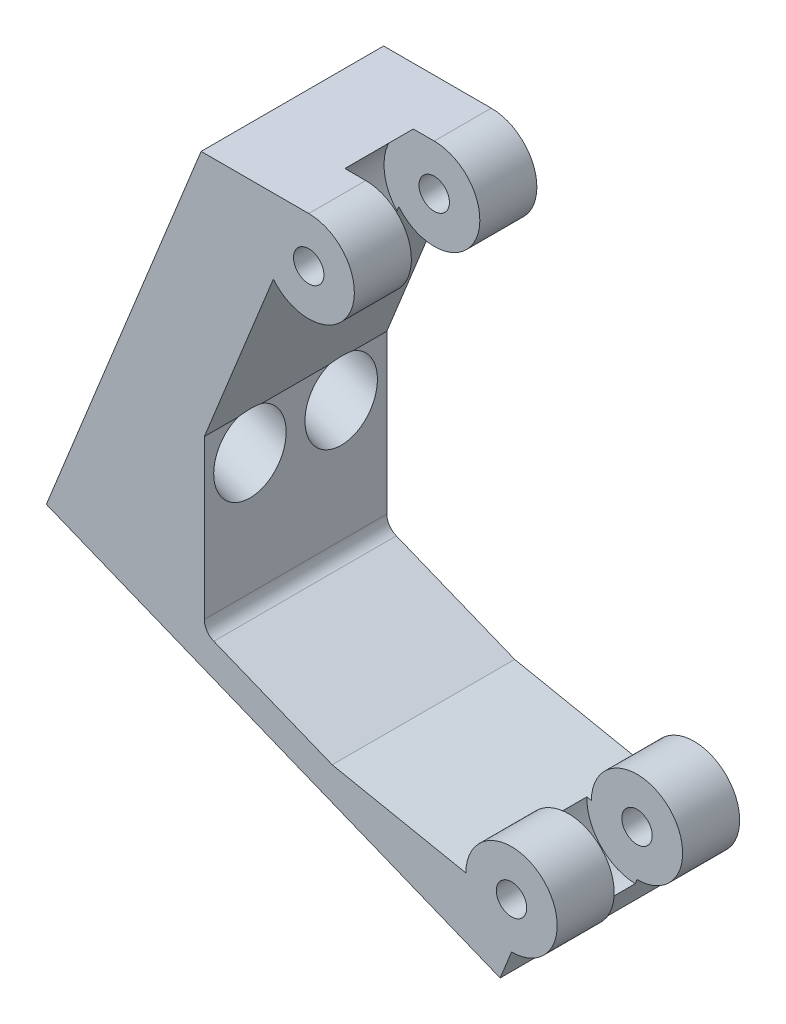
ISO-10303-21;
HEADER;
FILE_DESCRIPTION(('STEP AP214'),'2;1');
FILE_NAME('part.step','',(''),(''),'','','');
FILE_SCHEMA(('AUTOMOTIVE_DESIGN { 1 0 10303 214 1 1 1 1 }'));
ENDSEC;
DATA;
#1=APPLICATION_CONTEXT('core data for automotive mechanical design processes');
#2=APPLICATION_PROTOCOL_DEFINITION('international standard','automotive_design',2000,#1);
#3=PRODUCT_CONTEXT('',#1,'mechanical');
#4=PRODUCT('Part','Part','',(#3));
#5=PRODUCT_RELATED_PRODUCT_CATEGORY('part','',(#4));
#6=PRODUCT_DEFINITION_FORMATION('','',#4);
#7=PRODUCT_DEFINITION_CONTEXT('part definition',#1,'design');
#8=PRODUCT_DEFINITION('design','',#6,#7);
#9=PRODUCT_DEFINITION_SHAPE('','',#8);
#10=(LENGTH_UNIT() NAMED_UNIT(*) SI_UNIT(.MILLI.,.METRE.));
#11=(NAMED_UNIT(*) PLANE_ANGLE_UNIT() SI_UNIT($,.RADIAN.));
#12=(NAMED_UNIT(*) SI_UNIT($,.STERADIAN.) SOLID_ANGLE_UNIT());
#13=UNCERTAINTY_MEASURE_WITH_UNIT(LENGTH_MEASURE(1.E-05),#10,'distance_accuracy_value','');
#14=(GEOMETRIC_REPRESENTATION_CONTEXT(3) GLOBAL_UNCERTAINTY_ASSIGNED_CONTEXT((#13)) GLOBAL_UNIT_ASSIGNED_CONTEXT((#10,
#11,#12)) REPRESENTATION_CONTEXT('',''));
#15=CARTESIAN_POINT('',(0.,0.,0.));
#16=DIRECTION('',(0.,0.,1.));
#17=DIRECTION('',(1.,0.,0.));
#18=AXIS2_PLACEMENT_3D('',#15,#16,#17);
#19=CARTESIAN_POINT('',(32.3757683552172,15.7368485198035,6.));
#20=DIRECTION('',(-0.927183854566786,0.374606593415916,0.));
#21=DIRECTION('',(-0.374606593415916,-0.927183854566786,0.));
#22=AXIS2_PLACEMENT_3D('',#19,#20,#21);
#23=CYLINDRICAL_SURFACE('',#22,1.28840579710145);
#24=CARTESIAN_POINT('',(2.70034237489591,27.7264988786834,6.));
#25=DIRECTION('',(0.927183854566786,-0.374606593415916,0.));
#26=DIRECTION('',(0.374606593415916,0.927183854566786,0.));
#27=AXIS2_PLACEMENT_3D('',#24,#25,#26);
#28=CIRCLE('',#27,1.28840579710145);
#29=CARTESIAN_POINT('',(3.1829876814854,28.9210879318861,6.));
#30=VERTEX_POINT('',#29);
#31=EDGE_CURVE('E303',#30,#30,#28,.F.);
#32=ORIENTED_EDGE('',*,*,#31,.F.);
#33=EDGE_LOOP('',(#32));
#34=FACE_BOUND('',#33,.T.);
#35=CARTESIAN_POINT('',(-0.681358860110469,29.0927948655651,6.));
#36=DIRECTION('',(-0.927183854566787,0.374606593415913,0.));
#37=DIRECTION('',(-0.374606593415913,-0.927183854566787,0.));
#38=AXIS2_PLACEMENT_3D('',#35,#36,#37);
#39=CIRCLE('',#38,1.28840579710145);
#40=CARTESIAN_POINT('',(-1.16400416669996,27.8982058123624,6.));
#41=VERTEX_POINT('',#40);
#42=EDGE_CURVE('E391',#41,#41,#39,.F.);
#43=ORIENTED_EDGE('',*,*,#42,.F.);
#44=EDGE_LOOP('',(#43));
#45=FACE_BOUND('',#44,.T.);
#46=ADVANCED_FACE('F39',(#34,#45),#23,.F.);
#47=CARTESIAN_POINT('',(28.4302213363966,5.97127696398504,3.));
#48=DIRECTION('',(-0.927183854566786,0.374606593415916,0.));
#49=DIRECTION('',(-0.374606593415916,-0.927183854566786,0.));
#50=AXIS2_PLACEMENT_3D('',#47,#48,#49);
#51=CYLINDRICAL_SURFACE('',#50,1.28840579710145);
#52=CARTESIAN_POINT('',(-1.24520464392461,17.9609273228649,3.));
#53=DIRECTION('',(0.927183854566786,-0.374606593415916,0.));
#54=DIRECTION('',(0.374606593415916,0.927183854566786,0.));
#55=AXIS2_PLACEMENT_3D('',#52,#53,#54);
#56=CIRCLE('',#55,1.28840579710145);
#57=CARTESIAN_POINT('',(-0.762559337335123,19.1555163760677,3.));
#58=VERTEX_POINT('',#57);
#59=EDGE_CURVE('E299',#58,#58,#56,.F.);
#60=ORIENTED_EDGE('',*,*,#59,.F.);
#61=EDGE_LOOP('',(#60));
#62=FACE_BOUND('',#61,.T.);
#63=CARTESIAN_POINT('',(-4.62690587893096,19.3272233097467,3.));
#64=DIRECTION('',(-0.927183854566787,0.374606593415913,0.));
#65=DIRECTION('',(-0.374606593415913,-0.927183854566787,0.));
#66=AXIS2_PLACEMENT_3D('',#63,#64,#65);
#67=CIRCLE('',#66,1.28840579710145);
#68=CARTESIAN_POINT('',(-5.10955118552045,18.1326342565439,3.));
#69=VERTEX_POINT('',#68);
#70=EDGE_CURVE('E385',#69,#69,#67,.F.);
#71=ORIENTED_EDGE('',*,*,#70,.F.);
#72=EDGE_LOOP('',(#71));
#73=FACE_BOUND('',#72,.T.);
#74=ADVANCED_FACE('F419',(#62,#73),#51,.F.);
#75=CARTESIAN_POINT('',(28.4302213363966,5.97127696398504,9.));
#76=DIRECTION('',(-0.927183854566786,0.374606593415916,0.));
#77=DIRECTION('',(-0.374606593415916,-0.927183854566786,0.));
#78=AXIS2_PLACEMENT_3D('',#75,#76,#77);
#79=CYLINDRICAL_SURFACE('',#78,1.28840579710145);
#80=CARTESIAN_POINT('',(-1.24520464392461,17.9609273228649,9.));
#81=DIRECTION('',(0.927183854566786,-0.374606593415916,0.));
#82=DIRECTION('',(0.374606593415916,0.927183854566786,0.));
#83=AXIS2_PLACEMENT_3D('',#80,#81,#82);
#84=CIRCLE('',#83,1.28840579710145);
#85=CARTESIAN_POINT('',(-0.762559337335123,19.1555163760677,9.));
#86=VERTEX_POINT('',#85);
#87=EDGE_CURVE('E296',#86,#86,#84,.F.);
#88=ORIENTED_EDGE('',*,*,#87,.F.);
#89=EDGE_LOOP('',(#88));
#90=FACE_BOUND('',#89,.T.);
#91=CARTESIAN_POINT('',(-4.62690587893096,19.3272233097467,9.));
#92=DIRECTION('',(-0.927183854566787,0.374606593415913,0.));
#93=DIRECTION('',(-0.374606593415913,-0.927183854566787,0.));
#94=AXIS2_PLACEMENT_3D('',#91,#92,#93);
#95=CIRCLE('',#94,1.28840579710145);
#96=CARTESIAN_POINT('',(-5.10955118552045,18.1326342565439,9.));
#97=VERTEX_POINT('',#96);
#98=EDGE_CURVE('E382',#97,#97,#95,.F.);
#99=ORIENTED_EDGE('',*,*,#98,.F.);
#100=EDGE_LOOP('',(#99));
#101=FACE_BOUND('',#100,.T.);
#102=ADVANCED_FACE('F426',(#90,#101),#79,.F.);
#103=CARTESIAN_POINT('',(22.1992328045804,2.82866743447979,12.));
#104=DIRECTION('',(0.,0.,1.));
#105=DIRECTION('',(1.,0.,0.));
#106=AXIS2_PLACEMENT_3D('',#103,#104,#105);
#107=PLANE('',#106);
#108=CARTESIAN_POINT('',(8.86544020654602,32.2105327125229,12.));
#109=DIRECTION('',(0.,0.,1.));
#110=DIRECTION('',(1.,0.,0.));
#111=AXIS2_PLACEMENT_3D('',#108,#109,#110);
#112=CIRCLE('',#111,1.00000000000001);
#113=CARTESIAN_POINT('',(9.86544020654602,32.2105327125229,12.));
#114=VERTEX_POINT('',#113);
#115=EDGE_CURVE('E215',#114,#114,#112,.T.);
#116=ORIENTED_EDGE('',*,*,#115,.F.);
#117=EDGE_LOOP('',(#116));
#118=FACE_BOUND('',#117,.T.);
#119=CARTESIAN_POINT('',(22.1992328045804,2.82866743447979,12.));
#120=DIRECTION('',(0.,0.,1.));
#121=DIRECTION('',(1.,0.,0.));
#122=AXIS2_PLACEMENT_3D('',#119,#120,#121);
#123=CIRCLE('',#122,0.999999999999998);
#124=CARTESIAN_POINT('',(23.1992328045804,2.82866743447979,12.));
#125=VERTEX_POINT('',#124);
#126=EDGE_CURVE('E358',#125,#125,#123,.T.);
#127=ORIENTED_EDGE('',*,*,#126,.F.);
#128=EDGE_LOOP('',(#127));
#129=FACE_BOUND('',#128,.T.);
#130=DIRECTION('',(-1.,0.,0.));
#131=VECTOR('',#130,1.);
#132=CARTESIAN_POINT('',(0.,35.2105327125229,12.));
#133=LINE('',#132,#131);
#134=CARTESIAN_POINT('',(8.86544020654602,35.2105327125229,12.));
#135=VERTEX_POINT('',#134);
#136=CARTESIAN_POINT('',(1.79036767284478,35.2105327125229,12.));
#137=VERTEX_POINT('',#136);
#138=EDGE_CURVE('E192',#135,#137,#133,.T.);
#139=ORIENTED_EDGE('',*,*,#138,.T.);
#140=DIRECTION('',(-0.374606593415913,-0.927183854566787,0.));
#141=VECTOR('',#140,1.);
#142=CARTESIAN_POINT('',(-6.59282112902209,14.4614123193155,12.));
#143=LINE('',#142,#141);
#144=CARTESIAN_POINT('',(-8.38402187154173,10.0280349096757,12.));
#145=VERTEX_POINT('',#144);
#146=EDGE_CURVE('E181',#137,#145,#143,.T.);
#147=ORIENTED_EDGE('',*,*,#146,.T.);
#148=DIRECTION('',(0.927183854566787,-0.374606593415913,0.));
#149=VECTOR('',#148,1.);
#150=CARTESIAN_POINT('',(0.,6.64067019559725,12.));
#151=LINE('',#150,#149);
#152=CARTESIAN_POINT('',(21.4500196177493,-2.02570027465208,12.));
#153=VERTEX_POINT('',#152);
#154=EDGE_CURVE('E189',#145,#153,#151,.T.);
#155=ORIENTED_EDGE('',*,*,#154,.T.);
#156=DIRECTION('',(0.374606593415912,0.927183854566787,0.));
#157=VECTOR('',#156,1.);
#158=CARTESIAN_POINT('',(22.1992328045804,-0.17133256552021,12.));
#159=LINE('',#158,#157);
#160=CARTESIAN_POINT('',(22.1992328045804,-0.17133256552021,12.));
#161=VERTEX_POINT('',#160);
#162=EDGE_CURVE('E199',#153,#161,#159,.T.);
#163=ORIENTED_EDGE('',*,*,#162,.T.);
#164=CARTESIAN_POINT('',(22.1992328045804,2.82866743447979,12.));
#165=DIRECTION('',(0.,0.,1.));
#166=DIRECTION('',(1.,0.,0.));
#167=AXIS2_PLACEMENT_3D('',#164,#165,#166);
#168=CIRCLE('',#167,3.);
#169=CARTESIAN_POINT('',(19.1992328045804,2.82866743445759,12.));
#170=VERTEX_POINT('',#169);
#171=EDGE_CURVE('E201',#161,#170,#168,.T.);
#172=ORIENTED_EDGE('',*,*,#171,.T.);
#173=DIRECTION('',(-0.980453146044322,0.19675270877879,0.));
#174=VECTOR('',#173,1.);
#175=CARTESIAN_POINT('',(10.4069387354306,4.59306350117868,12.));
#176=LINE('',#175,#174);
#177=CARTESIAN_POINT('',(10.4069387354306,4.59306350117868,12.));
#178=VERTEX_POINT('',#177);
#179=EDGE_CURVE('E208',#170,#178,#176,.T.);
#180=ORIENTED_EDGE('',*,*,#179,.T.);
#181=DIRECTION('',(-0.927183854566787,0.374606593415913,0.));
#182=VECTOR('',#181,1.);
#183=CARTESIAN_POINT('',(2.,7.9896872292821,12.));
#184=LINE('',#183,#182);
#185=CARTESIAN_POINT('',(2.62539340658409,7.73701189155774,12.));
#186=VERTEX_POINT('',#185);
#187=EDGE_CURVE('E237',#178,#186,#184,.T.);
#188=ORIENTED_EDGE('',*,*,#187,.T.);
#189=CARTESIAN_POINT('',(3.,8.66419574612453,12.));
#190=DIRECTION('',(0.,0.,1.));
#191=DIRECTION('',(1.,0.,0.));
#192=AXIS2_PLACEMENT_3D('',#189,#190,#191);
#193=CIRCLE('',#192,1.);
#194=CARTESIAN_POINT('',(2.,8.66419574612453,12.));
#195=VERTEX_POINT('',#194);
#196=EDGE_CURVE('E293',#186,#195,#193,.F.);
#197=ORIENTED_EDGE('',*,*,#196,.T.);
#198=DIRECTION('',(0.,1.,0.));
#199=VECTOR('',#198,1.);
#200=CARTESIAN_POINT('',(2.,19.0742676197217,12.));
#201=LINE('',#200,#199);
#202=CARTESIAN_POINT('',(2.,19.0742676197217,12.));
#203=VERTEX_POINT('',#202);
#204=EDGE_CURVE('E370',#195,#203,#201,.T.);
#205=ORIENTED_EDGE('',*,*,#204,.T.);
#206=DIRECTION('',(0.374606593415916,0.927183854566786,0.));
#207=VECTOR('',#206,1.);
#208=CARTESIAN_POINT('',(6.54108801246308,30.3138548595753,12.));
#209=LINE('',#208,#207);
#210=CARTESIAN_POINT('',(6.54108801246308,30.3138548595753,12.));
#211=VERTEX_POINT('',#210);
#212=EDGE_CURVE('E372',#203,#211,#209,.T.);
#213=ORIENTED_EDGE('',*,*,#212,.T.);
#214=CARTESIAN_POINT('',(8.86544020654602,32.2105327125229,12.));
#215=DIRECTION('',(0.,0.,1.));
#216=DIRECTION('',(-1.,0.,0.));
#217=AXIS2_PLACEMENT_3D('',#214,#215,#216);
#218=CIRCLE('',#217,3.);
#219=EDGE_CURVE('E203',#211,#135,#218,.T.);
#220=ORIENTED_EDGE('',*,*,#219,.T.);
#221=EDGE_LOOP('',(#139,#147,#155,#163,#172,#180,#188,#197,#205,#213,#220));
#222=FACE_BOUND('',#221,.T.);
#223=ADVANCED_FACE('F188',(#118,#129,#222),#107,.T.);
#224=CARTESIAN_POINT('',(22.1992328045804,2.82866743447979,0.));
#225=DIRECTION('',(0.,0.,1.));
#226=DIRECTION('',(1.,0.,0.));
#227=AXIS2_PLACEMENT_3D('',#224,#225,#226);
#228=PLANE('',#227);
#229=CARTESIAN_POINT('',(22.1992328045804,2.82866743447979,0.));
#230=DIRECTION('',(0.,0.,1.));
#231=DIRECTION('',(1.,0.,0.));
#232=AXIS2_PLACEMENT_3D('',#229,#230,#231);
#233=CIRCLE('',#232,0.999999999999998);
#234=CARTESIAN_POINT('',(23.1992328045804,2.82866743447979,0.));
#235=VERTEX_POINT('',#234);
#236=EDGE_CURVE('E357',#235,#235,#233,.T.);
#237=ORIENTED_EDGE('',*,*,#236,.T.);
#238=EDGE_LOOP('',(#237));
#239=FACE_BOUND('',#238,.T.);
#240=CARTESIAN_POINT('',(8.86544020654602,32.2105327125229,0.));
#241=DIRECTION('',(0.,0.,1.));
#242=DIRECTION('',(1.,0.,0.));
#243=AXIS2_PLACEMENT_3D('',#240,#241,#242);
#244=CIRCLE('',#243,1.00000000000001);
#245=CARTESIAN_POINT('',(9.86544020654602,32.2105327125229,0.));
#246=VERTEX_POINT('',#245);
#247=EDGE_CURVE('E361',#246,#246,#244,.T.);
#248=ORIENTED_EDGE('',*,*,#247,.T.);
#249=EDGE_LOOP('',(#248));
#250=FACE_BOUND('',#249,.T.);
#251=DIRECTION('',(-0.374606593415913,-0.927183854566787,0.));
#252=VECTOR('',#251,1.);
#253=CARTESIAN_POINT('',(-6.59282112902209,14.4614123193155,0.));
#254=LINE('',#253,#252);
#255=CARTESIAN_POINT('',(1.79036767284478,35.2105327125229,0.));
#256=VERTEX_POINT('',#255);
#257=CARTESIAN_POINT('',(-8.38402187154172,10.0280349096757,0.));
#258=VERTEX_POINT('',#257);
#259=EDGE_CURVE('E53',#256,#258,#254,.T.);
#260=ORIENTED_EDGE('',*,*,#259,.F.);
#261=DIRECTION('',(-1.,0.,0.));
#262=VECTOR('',#261,1.);
#263=CARTESIAN_POINT('',(0.,35.2105327125229,0.));
#264=LINE('',#263,#262);
#265=CARTESIAN_POINT('',(8.86544020654602,35.2105327125229,0.));
#266=VERTEX_POINT('',#265);
#267=EDGE_CURVE('E224',#266,#256,#264,.T.);
#268=ORIENTED_EDGE('',*,*,#267,.F.);
#269=CARTESIAN_POINT('',(8.86544020654602,32.2105327125229,0.));
#270=DIRECTION('',(0.,0.,1.));
#271=DIRECTION('',(-1.,0.,0.));
#272=AXIS2_PLACEMENT_3D('',#269,#270,#271);
#273=CIRCLE('',#272,3.);
#274=CARTESIAN_POINT('',(6.54108801246308,30.3138548595753,0.));
#275=VERTEX_POINT('',#274);
#276=EDGE_CURVE('E221',#275,#266,#273,.T.);
#277=ORIENTED_EDGE('',*,*,#276,.F.);
#278=DIRECTION('',(0.374606593415916,0.927183854566786,0.));
#279=VECTOR('',#278,1.);
#280=CARTESIAN_POINT('',(6.54108801246308,30.3138548595753,0.));
#281=LINE('',#280,#279);
#282=CARTESIAN_POINT('',(2.,19.0742676197217,0.));
#283=VERTEX_POINT('',#282);
#284=EDGE_CURVE('E218',#283,#275,#281,.T.);
#285=ORIENTED_EDGE('',*,*,#284,.F.);
#286=DIRECTION('',(0.,1.,0.));
#287=VECTOR('',#286,1.);
#288=CARTESIAN_POINT('',(2.,19.0742676197217,0.));
#289=LINE('',#288,#287);
#290=CARTESIAN_POINT('',(2.,8.66419574612453,0.));
#291=VERTEX_POINT('',#290);
#292=EDGE_CURVE('E214',#291,#283,#289,.T.);
#293=ORIENTED_EDGE('',*,*,#292,.F.);
#294=CARTESIAN_POINT('',(3.,8.66419574612453,0.));
#295=DIRECTION('',(0.,0.,1.));
#296=DIRECTION('',(1.,0.,0.));
#297=AXIS2_PLACEMENT_3D('',#294,#295,#296);
#298=CIRCLE('',#297,1.);
#299=CARTESIAN_POINT('',(2.62539340658409,7.73701189155774,0.));
#300=VERTEX_POINT('',#299);
#301=EDGE_CURVE('E291',#291,#300,#298,.T.);
#302=ORIENTED_EDGE('',*,*,#301,.T.);
#303=DIRECTION('',(-0.927183854566787,0.374606593415913,0.));
#304=VECTOR('',#303,1.);
#305=CARTESIAN_POINT('',(2.,7.9896872292821,0.));
#306=LINE('',#305,#304);
#307=CARTESIAN_POINT('',(10.4069387354306,4.59306350117868,0.));
#308=VERTEX_POINT('',#307);
#309=EDGE_CURVE('E211',#308,#300,#306,.T.);
#310=ORIENTED_EDGE('',*,*,#309,.F.);
#311=DIRECTION('',(-0.980453146044322,0.19675270877879,0.));
#312=VECTOR('',#311,1.);
#313=CARTESIAN_POINT('',(10.4069387354306,4.59306350117868,0.));
#314=LINE('',#313,#312);
#315=CARTESIAN_POINT('',(19.1992328045804,2.82866743445759,0.));
#316=VERTEX_POINT('',#315);
#317=EDGE_CURVE('E235',#316,#308,#314,.T.);
#318=ORIENTED_EDGE('',*,*,#317,.F.);
#319=CARTESIAN_POINT('',(22.1992328045804,2.82866743447979,0.));
#320=DIRECTION('',(0.,0.,1.));
#321=DIRECTION('',(1.,0.,0.));
#322=AXIS2_PLACEMENT_3D('',#319,#320,#321);
#323=CIRCLE('',#322,3.);
#324=CARTESIAN_POINT('',(22.1992328045804,-0.17133256552021,0.));
#325=VERTEX_POINT('',#324);
#326=EDGE_CURVE('E232',#325,#316,#323,.T.);
#327=ORIENTED_EDGE('',*,*,#326,.F.);
#328=DIRECTION('',(0.374606593415912,0.927183854566787,0.));
#329=VECTOR('',#328,1.);
#330=CARTESIAN_POINT('',(22.1992328045804,-0.17133256552021,0.));
#331=LINE('',#330,#329);
#332=CARTESIAN_POINT('',(21.4500196177493,-2.02570027465208,0.));
#333=VERTEX_POINT('',#332);
#334=EDGE_CURVE('E229',#333,#325,#331,.T.);
#335=ORIENTED_EDGE('',*,*,#334,.F.);
#336=DIRECTION('',(0.927183854566787,-0.374606593415913,0.));
#337=VECTOR('',#336,1.);
#338=CARTESIAN_POINT('',(0.,6.64067019559725,0.));
#339=LINE('',#338,#337);
#340=EDGE_CURVE('E227',#258,#333,#339,.T.);
#341=ORIENTED_EDGE('',*,*,#340,.F.);
#342=EDGE_LOOP('',(#260,#268,#277,#285,#293,#302,#310,#318,#327,#335,#341));
#343=FACE_BOUND('',#342,.T.);
#344=ADVANCED_FACE('F470',(#239,#250,#343),#228,.F.);
#345=CARTESIAN_POINT('',(0.,35.2105327125229,12.));
#346=DIRECTION('',(0.,-1.,0.));
#347=DIRECTION('',(1.,0.,0.));
#348=AXIS2_PLACEMENT_3D('',#345,#346,#347);
#349=PLANE('',#348);
#350=DIRECTION('',(0.,0.,-1.));
#351=VECTOR('',#350,1.);
#352=CARTESIAN_POINT('',(1.79036767284479,35.2105327125229,12.));
#353=LINE('',#352,#351);
#354=EDGE_CURVE('E193',#137,#256,#353,.T.);
#355=ORIENTED_EDGE('',*,*,#354,.F.);
#356=ORIENTED_EDGE('',*,*,#138,.F.);
#357=DIRECTION('',(0.,0.,-1.));
#358=VECTOR('',#357,1.);
#359=CARTESIAN_POINT('',(8.86544020654602,35.2105327125229,12.));
#360=LINE('',#359,#358);
#361=CARTESIAN_POINT('',(8.86544020654602,35.2105327125229,8.25));
#362=VERTEX_POINT('',#361);
#363=EDGE_CURVE('E250',#135,#362,#360,.T.);
#364=ORIENTED_EDGE('',*,*,#363,.T.);
#365=DIRECTION('',(-1.,0.,0.));
#366=VECTOR('',#365,1.);
#367=CARTESIAN_POINT('',(0.,35.2105327125229,8.25));
#368=LINE('',#367,#366);
#369=CARTESIAN_POINT('',(7.49066749805929,35.2105327125229,8.25));
#370=VERTEX_POINT('',#369);
#371=EDGE_CURVE('E281',#362,#370,#368,.T.);
#372=ORIENTED_EDGE('',*,*,#371,.T.);
#373=DIRECTION('',(0.,0.,-1.));
#374=VECTOR('',#373,1.);
#375=CARTESIAN_POINT('',(7.49066749805929,35.2105327125229,8.25));
#376=LINE('',#375,#374);
#377=CARTESIAN_POINT('',(7.49066749805929,35.2105327125229,3.75));
#378=VERTEX_POINT('',#377);
#379=EDGE_CURVE('E284',#378,#370,#376,.F.);
#380=ORIENTED_EDGE('',*,*,#379,.F.);
#381=DIRECTION('',(-1.,0.,0.));
#382=VECTOR('',#381,1.);
#383=CARTESIAN_POINT('',(0.,35.2105327125229,3.75));
#384=LINE('',#383,#382);
#385=CARTESIAN_POINT('',(8.86544020654602,35.2105327125229,3.75));
#386=VERTEX_POINT('',#385);
#387=EDGE_CURVE('E276',#386,#378,#384,.T.);
#388=ORIENTED_EDGE('',*,*,#387,.F.);
#389=EDGE_CURVE('E249',#386,#266,#360,.T.);
#390=ORIENTED_EDGE('',*,*,#389,.T.);
#391=ORIENTED_EDGE('',*,*,#267,.T.);
#392=EDGE_LOOP('',(#355,#356,#364,#372,#380,#388,#390,#391));
#393=FACE_BOUND('',#392,.T.);
#394=ADVANCED_FACE('F380',(#393),#349,.F.);
#395=CARTESIAN_POINT('',(0.,6.64067019559725,12.));
#396=DIRECTION('',(0.374606593415913,0.927183854566787,0.));
#397=DIRECTION('',(-0.927183854566787,0.374606593415913,0.));
#398=AXIS2_PLACEMENT_3D('',#395,#396,#397);
#399=PLANE('',#398);
#400=DIRECTION('',(0.,0.,1.));
#401=VECTOR('',#400,1.);
#402=CARTESIAN_POINT('',(-8.38402187154173,10.0280349096757,12.));
#403=LINE('',#402,#401);
#404=EDGE_CURVE('E11',#258,#145,#403,.T.);
#405=ORIENTED_EDGE('',*,*,#404,.F.);
#406=ORIENTED_EDGE('',*,*,#340,.T.);
#407=DIRECTION('',(0.,0.,-1.));
#408=VECTOR('',#407,1.);
#409=CARTESIAN_POINT('',(21.4500196177493,-2.02570027465208,12.));
#410=LINE('',#409,#408);
#411=EDGE_CURVE('E197',#153,#333,#410,.T.);
#412=ORIENTED_EDGE('',*,*,#411,.F.);
#413=ORIENTED_EDGE('',*,*,#154,.F.);
#414=EDGE_LOOP('',(#405,#406,#412,#413));
#415=FACE_BOUND('',#414,.T.);
#416=ADVANCED_FACE('F195',(#415),#399,.F.);
#417=CARTESIAN_POINT('',(8.86544020654602,32.2105327125229,12.));
#418=DIRECTION('',(0.,0.,-1.));
#419=DIRECTION('',(-1.,0.,0.));
#420=AXIS2_PLACEMENT_3D('',#417,#418,#419);
#421=CYLINDRICAL_SURFACE('',#420,3.);
#422=CARTESIAN_POINT('',(8.86544020654602,32.2105327125229,3.75));
#423=DIRECTION('',(0.,0.,1.));
#424=DIRECTION('',(1.,0.,0.));
#425=AXIS2_PLACEMENT_3D('',#422,#423,#424);
#426=CIRCLE('',#425,3.);
#427=CARTESIAN_POINT('',(6.54108801246308,30.3138548595753,3.75));
#428=VERTEX_POINT('',#427);
#429=EDGE_CURVE('E342',#428,#386,#426,.T.);
#430=ORIENTED_EDGE('',*,*,#429,.F.);
#431=DIRECTION('',(0.,0.,-1.));
#432=VECTOR('',#431,1.);
#433=CARTESIAN_POINT('',(6.54108801246308,30.3138548595753,12.));
#434=LINE('',#433,#432);
#435=EDGE_CURVE('E253',#428,#275,#434,.T.);
#436=ORIENTED_EDGE('',*,*,#435,.T.);
#437=ORIENTED_EDGE('',*,*,#276,.T.);
#438=ORIENTED_EDGE('',*,*,#389,.F.);
#439=EDGE_LOOP('',(#430,#436,#437,#438));
#440=FACE_BOUND('',#439,.T.);
#441=ADVANCED_FACE('F489',(#440),#421,.T.);
#442=CARTESIAN_POINT('',(22.1992328045804,2.82866743447979,12.));
#443=DIRECTION('',(0.,0.,-1.));
#444=DIRECTION('',(-1.,0.,0.));
#445=AXIS2_PLACEMENT_3D('',#442,#443,#444);
#446=CYLINDRICAL_SURFACE('',#445,3.);
#447=CARTESIAN_POINT('',(22.1992328045804,2.82866743447979,3.75));
#448=DIRECTION('',(0.,0.,1.));
#449=DIRECTION('',(1.,0.,0.));
#450=AXIS2_PLACEMENT_3D('',#447,#448,#449);
#451=CIRCLE('',#450,3.);
#452=CARTESIAN_POINT('',(22.1992328045804,-0.17133256552021,3.75));
#453=VERTEX_POINT('',#452);
#454=CARTESIAN_POINT('',(19.1992328045804,2.82866743445759,3.75));
#455=VERTEX_POINT('',#454);
#456=EDGE_CURVE('E331',#453,#455,#451,.T.);
#457=ORIENTED_EDGE('',*,*,#456,.F.);
#458=DIRECTION('',(0.,0.,-1.));
#459=VECTOR('',#458,1.);
#460=CARTESIAN_POINT('',(22.1992328045804,-0.17133256552021,12.));
#461=LINE('',#460,#459);
#462=EDGE_CURVE('E244',#453,#325,#461,.T.);
#463=ORIENTED_EDGE('',*,*,#462,.T.);
#464=ORIENTED_EDGE('',*,*,#326,.T.);
#465=DIRECTION('',(0.,0.,-1.));
#466=VECTOR('',#465,1.);
#467=CARTESIAN_POINT('',(19.1992328045804,2.82866743445759,12.));
#468=LINE('',#467,#466);
#469=EDGE_CURVE('E240',#455,#316,#468,.T.);
#470=ORIENTED_EDGE('',*,*,#469,.F.);
#471=EDGE_LOOP('',(#457,#463,#464,#470));
#472=FACE_BOUND('',#471,.T.);
#473=ADVANCED_FACE('F483',(#472),#446,.T.);
#474=CARTESIAN_POINT('',(8.86544020654602,32.2105327125229,12.));
#475=DIRECTION('',(0.,0.,-1.));
#476=DIRECTION('',(-1.,0.,0.));
#477=AXIS2_PLACEMENT_3D('',#474,#475,#476);
#478=CYLINDRICAL_SURFACE('',#477,1.00000000000001);
#479=ORIENTED_EDGE('',*,*,#247,.F.);
#480=EDGE_LOOP('',(#479));
#481=FACE_BOUND('',#480,.T.);
#482=CARTESIAN_POINT('',(8.86544020654602,32.2105327125229,3.75));
#483=DIRECTION('',(0.,0.,1.));
#484=DIRECTION('',(1.,0.,0.));
#485=AXIS2_PLACEMENT_3D('',#482,#483,#484);
#486=CIRCLE('',#485,1.00000000000001);
#487=CARTESIAN_POINT('',(9.86544020654602,32.2105327125229,3.75));
#488=VERTEX_POINT('',#487);
#489=EDGE_CURVE('E273',#488,#488,#486,.T.);
#490=ORIENTED_EDGE('',*,*,#489,.T.);
#491=EDGE_LOOP('',(#490));
#492=FACE_BOUND('',#491,.T.);
#493=ADVANCED_FACE('F467',(#481,#492),#478,.F.);
#494=CARTESIAN_POINT('',(22.1992328045804,2.82866743447979,12.));
#495=DIRECTION('',(0.,0.,-1.));
#496=DIRECTION('',(-1.,0.,0.));
#497=AXIS2_PLACEMENT_3D('',#494,#495,#496);
#498=CYLINDRICAL_SURFACE('',#497,0.999999999999998);
#499=ORIENTED_EDGE('',*,*,#236,.F.);
#500=EDGE_LOOP('',(#499));
#501=FACE_BOUND('',#500,.T.);
#502=CARTESIAN_POINT('',(22.1992328045804,2.82866743447979,3.75));
#503=DIRECTION('',(0.,0.,1.));
#504=DIRECTION('',(1.,0.,0.));
#505=AXIS2_PLACEMENT_3D('',#502,#503,#504);
#506=CIRCLE('',#505,0.999999999999998);
#507=CARTESIAN_POINT('',(23.1992328045804,2.82866743447979,3.75));
#508=VERTEX_POINT('',#507);
#509=EDGE_CURVE('E263',#508,#508,#506,.T.);
#510=ORIENTED_EDGE('',*,*,#509,.T.);
#511=EDGE_LOOP('',(#510));
#512=FACE_BOUND('',#511,.T.);
#513=ADVANCED_FACE('F462',(#501,#512),#498,.F.);
#514=CARTESIAN_POINT('',(2.,7.9896872292821,12.));
#515=DIRECTION('',(-0.374606593415913,-0.927183854566787,0.));
#516=DIRECTION('',(0.927183854566787,-0.374606593415913,0.));
#517=AXIS2_PLACEMENT_3D('',#514,#515,#516);
#518=PLANE('',#517);
#519=ORIENTED_EDGE('',*,*,#309,.T.);
#520=DIRECTION('',(0.,0.,-1.));
#521=VECTOR('',#520,1.);
#522=CARTESIAN_POINT('',(2.62539340658409,7.73701189155774,12.));
#523=LINE('',#522,#521);
#524=EDGE_CURVE('E289',#300,#186,#523,.F.);
#525=ORIENTED_EDGE('',*,*,#524,.T.);
#526=ORIENTED_EDGE('',*,*,#187,.F.);
#527=DIRECTION('',(0.,0.,-1.));
#528=VECTOR('',#527,1.);
#529=CARTESIAN_POINT('',(10.4069387354306,4.59306350117868,12.));
#530=LINE('',#529,#528);
#531=EDGE_CURVE('E210',#178,#308,#530,.T.);
#532=ORIENTED_EDGE('',*,*,#531,.T.);
#533=EDGE_LOOP('',(#519,#525,#526,#532));
#534=FACE_BOUND('',#533,.T.);
#535=ADVANCED_FACE('F500',(#534),#518,.F.);
#536=CARTESIAN_POINT('',(2.,19.0742676197217,12.));
#537=DIRECTION('',(-1.,0.,0.));
#538=DIRECTION('',(0.,-1.,0.));
#539=AXIS2_PLACEMENT_3D('',#536,#537,#538);
#540=PLANE('',#539);
#541=CARTESIAN_POINT('',(2.,16.6497795385173,9.));
#542=DIRECTION('',(-1.,0.,0.));
#543=DIRECTION('',(0.,1.,0.));
#544=AXIS2_PLACEMENT_3D('',#541,#542,#543);
#545=ELLIPSE('',#544,2.568260856001,2.38125);
#546=CARTESIAN_POINT('',(2.,19.0742676197217,9.78555039574403));
#547=VERTEX_POINT('',#546);
#548=CARTESIAN_POINT('',(2.,19.0742676197217,8.21444960425597));
#549=VERTEX_POINT('',#548);
#550=EDGE_CURVE('E310',#547,#549,#545,.F.);
#551=ORIENTED_EDGE('',*,*,#550,.F.);
#552=DIRECTION('',(0.,0.,-1.));
#553=VECTOR('',#552,1.);
#554=CARTESIAN_POINT('',(2.,19.0742676197217,12.));
#555=LINE('',#554,#553);
#556=EDGE_CURVE('E258',#203,#547,#555,.T.);
#557=ORIENTED_EDGE('',*,*,#556,.F.);
#558=ORIENTED_EDGE('',*,*,#204,.F.);
#559=DIRECTION('',(0.,0.,-1.));
#560=VECTOR('',#559,1.);
#561=CARTESIAN_POINT('',(2.,8.66419574612453,0.));
#562=LINE('',#561,#560);
#563=EDGE_CURVE('E286',#195,#291,#562,.T.);
#564=ORIENTED_EDGE('',*,*,#563,.T.);
#565=ORIENTED_EDGE('',*,*,#292,.T.);
#566=CARTESIAN_POINT('',(2.,19.0742676197217,2.21444960425597));
#567=VERTEX_POINT('',#566);
#568=EDGE_CURVE('E257',#567,#283,#555,.T.);
#569=ORIENTED_EDGE('',*,*,#568,.F.);
#570=CARTESIAN_POINT('',(2.,16.6497795385173,3.));
#571=DIRECTION('',(-1.,0.,0.));
#572=DIRECTION('',(0.,1.,0.));
#573=AXIS2_PLACEMENT_3D('',#570,#571,#572);
#574=ELLIPSE('',#573,2.568260856001,2.38125);
#575=CARTESIAN_POINT('',(2.,19.0742676197217,3.78555039574403));
#576=VERTEX_POINT('',#575);
#577=EDGE_CURVE('E60',#576,#567,#574,.F.);
#578=ORIENTED_EDGE('',*,*,#577,.F.);
#579=EDGE_CURVE('E262',#549,#576,#555,.T.);
#580=ORIENTED_EDGE('',*,*,#579,.F.);
#581=EDGE_LOOP('',(#551,#557,#558,#564,#565,#569,#578,#580));
#582=FACE_BOUND('',#581,.T.);
#583=ADVANCED_FACE('F497',(#582),#540,.F.);
#584=CARTESIAN_POINT('',(6.54108801246308,30.3138548595753,12.));
#585=DIRECTION('',(-0.927183854566786,0.374606593415916,0.));
#586=DIRECTION('',(-0.374606593415916,-0.927183854566786,0.));
#587=AXIS2_PLACEMENT_3D('',#584,#585,#586);
#588=PLANE('',#587);
#589=CARTESIAN_POINT('',(5.10345154897717,26.7555797488095,6.));
#590=DIRECTION('',(-0.927183854566786,0.374606593415916,0.));
#591=DIRECTION('',(-0.374606593415916,-0.927183854566786,0.));
#592=AXIS2_PLACEMENT_3D('',#589,#590,#591);
#593=CIRCLE('',#592,2.38125);
#594=CARTESIAN_POINT('',(4.21141959840552,24.5477231951223,6.));
#595=VERTEX_POINT('',#594);
#596=EDGE_CURVE('E307',#595,#595,#593,.F.);
#597=ORIENTED_EDGE('',*,*,#596,.F.);
#598=EDGE_LOOP('',(#597));
#599=FACE_BOUND('',#598,.T.);
#600=CARTESIAN_POINT('',(1.15790453015665,16.990008192991,9.));
#601=DIRECTION('',(-0.927183854566786,0.374606593415916,0.));
#602=DIRECTION('',(-0.374606593415916,-0.927183854566786,0.));
#603=AXIS2_PLACEMENT_3D('',#600,#601,#602);
#604=CIRCLE('',#603,2.38125);
#605=EDGE_CURVE('E47',#549,#547,#604,.F.);
#606=ORIENTED_EDGE('',*,*,#605,.F.);
#607=ORIENTED_EDGE('',*,*,#579,.T.);
#608=CARTESIAN_POINT('',(1.15790453015665,16.990008192991,3.));
#609=DIRECTION('',(-0.927183854566786,0.374606593415916,0.));
#610=DIRECTION('',(-0.374606593415916,-0.927183854566786,0.));
#611=AXIS2_PLACEMENT_3D('',#608,#609,#610);
#612=CIRCLE('',#611,2.38125);
#613=EDGE_CURVE('E295',#567,#576,#612,.F.);
#614=ORIENTED_EDGE('',*,*,#613,.F.);
#615=ORIENTED_EDGE('',*,*,#568,.T.);
#616=ORIENTED_EDGE('',*,*,#284,.T.);
#617=ORIENTED_EDGE('',*,*,#435,.F.);
#618=DIRECTION('',(0.374606593415916,0.927183854566786,0.));
#619=VECTOR('',#618,1.);
#620=CARTESIAN_POINT('',(6.54108801246308,30.3138548595753,3.75));
#621=LINE('',#620,#619);
#622=CARTESIAN_POINT('',(6.41457462593287,30.0007232397932,3.75));
#623=VERTEX_POINT('',#622);
#624=EDGE_CURVE('E282',#623,#428,#621,.T.);
#625=ORIENTED_EDGE('',*,*,#624,.F.);
#626=DIRECTION('',(0.,0.,-1.));
#627=VECTOR('',#626,1.);
#628=CARTESIAN_POINT('',(6.41457462593287,30.0007232397932,8.25));
#629=LINE('',#628,#627);
#630=CARTESIAN_POINT('',(6.41457462593287,30.0007232397932,8.25));
#631=VERTEX_POINT('',#630);
#632=EDGE_CURVE('E355',#631,#623,#629,.T.);
#633=ORIENTED_EDGE('',*,*,#632,.F.);
#634=DIRECTION('',(0.374606593415916,0.927183854566786,0.));
#635=VECTOR('',#634,1.);
#636=CARTESIAN_POINT('',(6.54108801246308,30.3138548595753,8.25));
#637=LINE('',#636,#635);
#638=CARTESIAN_POINT('',(6.54108801246308,30.3138548595753,8.25));
#639=VERTEX_POINT('',#638);
#640=EDGE_CURVE('E350',#631,#639,#637,.T.);
#641=ORIENTED_EDGE('',*,*,#640,.T.);
#642=EDGE_CURVE('E254',#211,#639,#434,.T.);
#643=ORIENTED_EDGE('',*,*,#642,.F.);
#644=ORIENTED_EDGE('',*,*,#212,.F.);
#645=ORIENTED_EDGE('',*,*,#556,.T.);
#646=EDGE_LOOP('',(#606,#607,#614,#615,#616,#617,#625,#633,#641,#643,#644,#645));
#647=FACE_BOUND('',#646,.T.);
#648=ADVANCED_FACE('F494',(#599,#647),#588,.F.);
#649=ORIENTED_EDGE('',*,*,#642,.T.);
#650=CARTESIAN_POINT('',(8.86544020654602,32.2105327125229,8.25));
#651=DIRECTION('',(0.,0.,1.));
#652=DIRECTION('',(1.,0.,0.));
#653=AXIS2_PLACEMENT_3D('',#650,#651,#652);
#654=CIRCLE('',#653,3.);
#655=EDGE_CURVE('E347',#639,#362,#654,.T.);
#656=ORIENTED_EDGE('',*,*,#655,.T.);
#657=ORIENTED_EDGE('',*,*,#363,.F.);
#658=ORIENTED_EDGE('',*,*,#219,.F.);
#659=EDGE_LOOP('',(#649,#656,#657,#658));
#660=FACE_BOUND('',#659,.T.);
#661=ADVANCED_FACE('F378',(#660),#421,.T.);
#662=CARTESIAN_POINT('',(22.1992328045804,-0.17133256552021,12.));
#663=DIRECTION('',(-0.927183854566787,0.374606593415912,0.));
#664=DIRECTION('',(-0.374606593415912,-0.927183854566787,0.));
#665=AXIS2_PLACEMENT_3D('',#662,#663,#664);
#666=PLANE('',#665);
#667=DIRECTION('',(0.,0.,-1.));
#668=VECTOR('',#667,1.);
#669=CARTESIAN_POINT('',(22.0789114706489,-0.469138317319572,8.25));
#670=LINE('',#669,#668);
#671=CARTESIAN_POINT('',(22.0789114706489,-0.469138317319572,8.25));
#672=VERTEX_POINT('',#671);
#673=CARTESIAN_POINT('',(22.0789114706489,-0.469138317319572,3.75));
#674=VERTEX_POINT('',#673);
#675=EDGE_CURVE('E353',#672,#674,#670,.T.);
#676=ORIENTED_EDGE('',*,*,#675,.F.);
#677=DIRECTION('',(0.374606593415912,0.927183854566787,0.));
#678=VECTOR('',#677,1.);
#679=CARTESIAN_POINT('',(22.1992328045804,-0.17133256552021,8.25));
#680=LINE('',#679,#678);
#681=CARTESIAN_POINT('',(22.1992328045804,-0.17133256552021,8.25));
#682=VERTEX_POINT('',#681);
#683=EDGE_CURVE('E277',#672,#682,#680,.T.);
#684=ORIENTED_EDGE('',*,*,#683,.T.);
#685=EDGE_CURVE('E245',#161,#682,#461,.T.);
#686=ORIENTED_EDGE('',*,*,#685,.F.);
#687=ORIENTED_EDGE('',*,*,#162,.F.);
#688=ORIENTED_EDGE('',*,*,#411,.T.);
#689=ORIENTED_EDGE('',*,*,#334,.T.);
#690=ORIENTED_EDGE('',*,*,#462,.F.);
#691=DIRECTION('',(0.374606593415912,0.927183854566787,0.));
#692=VECTOR('',#691,1.);
#693=CARTESIAN_POINT('',(22.1992328045804,-0.17133256552021,3.75));
#694=LINE('',#693,#692);
#695=EDGE_CURVE('E272',#674,#453,#694,.T.);
#696=ORIENTED_EDGE('',*,*,#695,.F.);
#697=EDGE_LOOP('',(#676,#684,#686,#687,#688,#689,#690,#696));
#698=FACE_BOUND('',#697,.T.);
#699=ADVANCED_FACE('F481',(#698),#666,.F.);
#700=ORIENTED_EDGE('',*,*,#685,.T.);
#701=CARTESIAN_POINT('',(22.1992328045804,2.82866743447979,8.25));
#702=DIRECTION('',(0.,0.,1.));
#703=DIRECTION('',(1.,0.,0.));
#704=AXIS2_PLACEMENT_3D('',#701,#702,#703);
#705=CIRCLE('',#704,3.);
#706=CARTESIAN_POINT('',(19.1992328045804,2.8286674344576,8.25));
#707=VERTEX_POINT('',#706);
#708=EDGE_CURVE('E336',#682,#707,#705,.T.);
#709=ORIENTED_EDGE('',*,*,#708,.T.);
#710=EDGE_CURVE('E241',#170,#707,#468,.T.);
#711=ORIENTED_EDGE('',*,*,#710,.F.);
#712=ORIENTED_EDGE('',*,*,#171,.F.);
#713=EDGE_LOOP('',(#700,#709,#711,#712));
#714=FACE_BOUND('',#713,.T.);
#715=ADVANCED_FACE('F477',(#714),#446,.T.);
#716=CARTESIAN_POINT('',(10.4069387354306,4.59306350117868,12.));
#717=DIRECTION('',(-0.19675270877879,-0.980453146044322,0.));
#718=DIRECTION('',(0.980453146044322,-0.19675270877879,0.));
#719=AXIS2_PLACEMENT_3D('',#716,#717,#718);
#720=PLANE('',#719);
#721=ORIENTED_EDGE('',*,*,#710,.T.);
#722=DIRECTION('',(-0.980453146044322,0.19675270877879,0.));
#723=VECTOR('',#722,1.);
#724=CARTESIAN_POINT('',(10.4069387354306,4.59306350117868,8.25));
#725=LINE('',#724,#723);
#726=CARTESIAN_POINT('',(18.8997799926433,2.8887602110862,8.25));
#727=VERTEX_POINT('',#726);
#728=EDGE_CURVE('E271',#707,#727,#725,.T.);
#729=ORIENTED_EDGE('',*,*,#728,.T.);
#730=DIRECTION('',(0.,0.,-1.));
#731=VECTOR('',#730,1.);
#732=CARTESIAN_POINT('',(18.8997799926433,2.8887602110862,8.25));
#733=LINE('',#732,#731);
#734=CARTESIAN_POINT('',(18.8997799926433,2.8887602110862,3.75));
#735=VERTEX_POINT('',#734);
#736=EDGE_CURVE('E261',#735,#727,#733,.F.);
#737=ORIENTED_EDGE('',*,*,#736,.F.);
#738=DIRECTION('',(-0.980453146044322,0.19675270877879,0.));
#739=VECTOR('',#738,1.);
#740=CARTESIAN_POINT('',(10.4069387354306,4.59306350117868,3.75));
#741=LINE('',#740,#739);
#742=EDGE_CURVE('E266',#455,#735,#741,.T.);
#743=ORIENTED_EDGE('',*,*,#742,.F.);
#744=ORIENTED_EDGE('',*,*,#469,.T.);
#745=ORIENTED_EDGE('',*,*,#317,.T.);
#746=ORIENTED_EDGE('',*,*,#531,.F.);
#747=ORIENTED_EDGE('',*,*,#179,.F.);
#748=EDGE_LOOP('',(#721,#729,#737,#743,#744,#745,#746,#747));
#749=FACE_BOUND('',#748,.T.);
#750=ADVANCED_FACE('F465',(#749),#720,.F.);
#751=CARTESIAN_POINT('',(8.86544020654602,32.2105327125229,8.25));
#752=DIRECTION('',(0.,0.,1.));
#753=DIRECTION('',(1.,0.,0.));
#754=AXIS2_PLACEMENT_3D('',#751,#752,#753);
#755=CIRCLE('',#754,1.00000000000001);
#756=CARTESIAN_POINT('',(9.86544020654602,32.2105327125229,8.25));
#757=VERTEX_POINT('',#756);
#758=EDGE_CURVE('E278',#757,#757,#755,.T.);
#759=ORIENTED_EDGE('',*,*,#758,.F.);
#760=EDGE_LOOP('',(#759));
#761=FACE_BOUND('',#760,.T.);
#762=ORIENTED_EDGE('',*,*,#115,.T.);
#763=EDGE_LOOP('',(#762));
#764=FACE_BOUND('',#763,.T.);
#765=ADVANCED_FACE('F460',(#761,#764),#478,.F.);
#766=CARTESIAN_POINT('',(22.1992328045804,2.82866743447979,8.25));
#767=DIRECTION('',(0.,0.,1.));
#768=DIRECTION('',(1.,0.,0.));
#769=AXIS2_PLACEMENT_3D('',#766,#767,#768);
#770=CIRCLE('',#769,0.999999999999998);
#771=CARTESIAN_POINT('',(23.1992328045804,2.82866743447979,8.25));
#772=VERTEX_POINT('',#771);
#773=EDGE_CURVE('E268',#772,#772,#770,.T.);
#774=ORIENTED_EDGE('',*,*,#773,.F.);
#775=EDGE_LOOP('',(#774));
#776=FACE_BOUND('',#775,.T.);
#777=ORIENTED_EDGE('',*,*,#126,.T.);
#778=EDGE_LOOP('',(#777));
#779=FACE_BOUND('',#778,.T.);
#780=ADVANCED_FACE('F456',(#776,#779),#498,.F.);
#781=CARTESIAN_POINT('',(22.1992328045804,2.82866743447979,8.25));
#782=DIRECTION('',(0.,0.,-1.));
#783=DIRECTION('',(-1.,0.,0.));
#784=AXIS2_PLACEMENT_3D('',#781,#782,#783);
#785=CYLINDRICAL_SURFACE('',#784,3.3);
#786=ORIENTED_EDGE('',*,*,#675,.T.);
#787=CARTESIAN_POINT('',(22.1992328045804,2.82866743447979,3.75));
#788=DIRECTION('',(0.,0.,1.));
#789=DIRECTION('',(1.,0.,0.));
#790=AXIS2_PLACEMENT_3D('',#787,#788,#789);
#791=CIRCLE('',#790,3.3);
#792=EDGE_CURVE('E309',#735,#674,#791,.T.);
#793=ORIENTED_EDGE('',*,*,#792,.F.);
#794=ORIENTED_EDGE('',*,*,#736,.T.);
#795=CARTESIAN_POINT('',(22.1992328045804,2.82866743447979,8.25));
#796=DIRECTION('',(0.,0.,1.));
#797=DIRECTION('',(1.,0.,0.));
#798=AXIS2_PLACEMENT_3D('',#795,#796,#797);
#799=CIRCLE('',#798,3.3);
#800=EDGE_CURVE('E314',#727,#672,#799,.T.);
#801=ORIENTED_EDGE('',*,*,#800,.T.);
#802=EDGE_LOOP('',(#786,#793,#794,#801));
#803=FACE_BOUND('',#802,.T.);
#804=ADVANCED_FACE('F452',(#803),#785,.F.);
#805=CARTESIAN_POINT('',(22.1992328045804,2.82866743447979,8.25));
#806=DIRECTION('',(0.,0.,1.));
#807=DIRECTION('',(1.,0.,0.));
#808=AXIS2_PLACEMENT_3D('',#805,#806,#807);
#809=PLANE('',#808);
#810=ORIENTED_EDGE('',*,*,#773,.T.);
#811=EDGE_LOOP('',(#810));
#812=FACE_BOUND('',#811,.T.);
#813=ORIENTED_EDGE('',*,*,#800,.F.);
#814=ORIENTED_EDGE('',*,*,#728,.F.);
#815=ORIENTED_EDGE('',*,*,#708,.F.);
#816=ORIENTED_EDGE('',*,*,#683,.F.);
#817=EDGE_LOOP('',(#813,#814,#815,#816));
#818=FACE_BOUND('',#817,.T.);
#819=ADVANCED_FACE('F448',(#812,#818),#809,.F.);
#820=CARTESIAN_POINT('',(22.1992328045804,2.82866743447979,3.75));
#821=DIRECTION('',(0.,0.,1.));
#822=DIRECTION('',(1.,0.,0.));
#823=AXIS2_PLACEMENT_3D('',#820,#821,#822);
#824=PLANE('',#823);
#825=ORIENTED_EDGE('',*,*,#509,.F.);
#826=EDGE_LOOP('',(#825));
#827=FACE_BOUND('',#826,.T.);
#828=ORIENTED_EDGE('',*,*,#695,.T.);
#829=ORIENTED_EDGE('',*,*,#456,.T.);
#830=ORIENTED_EDGE('',*,*,#742,.T.);
#831=ORIENTED_EDGE('',*,*,#792,.T.);
#832=EDGE_LOOP('',(#828,#829,#830,#831));
#833=FACE_BOUND('',#832,.T.);
#834=ADVANCED_FACE('F444',(#827,#833),#824,.T.);
#835=CARTESIAN_POINT('',(8.86544020654602,32.2105327125229,8.25));
#836=DIRECTION('',(0.,0.,-1.));
#837=DIRECTION('',(-1.,0.,0.));
#838=AXIS2_PLACEMENT_3D('',#835,#836,#837);
#839=CYLINDRICAL_SURFACE('',#838,3.3);
#840=ORIENTED_EDGE('',*,*,#632,.T.);
#841=CARTESIAN_POINT('',(8.86544020654602,32.2105327125229,3.75));
#842=DIRECTION('',(0.,0.,1.));
#843=DIRECTION('',(1.,0.,0.));
#844=AXIS2_PLACEMENT_3D('',#841,#842,#843);
#845=CIRCLE('',#844,3.3);
#846=EDGE_CURVE('E323',#378,#623,#845,.T.);
#847=ORIENTED_EDGE('',*,*,#846,.F.);
#848=ORIENTED_EDGE('',*,*,#379,.T.);
#849=CARTESIAN_POINT('',(8.86544020654602,32.2105327125229,8.25));
#850=DIRECTION('',(0.,0.,1.));
#851=DIRECTION('',(1.,0.,0.));
#852=AXIS2_PLACEMENT_3D('',#849,#850,#851);
#853=CIRCLE('',#852,3.3);
#854=EDGE_CURVE('E267',#370,#631,#853,.T.);
#855=ORIENTED_EDGE('',*,*,#854,.T.);
#856=EDGE_LOOP('',(#840,#847,#848,#855));
#857=FACE_BOUND('',#856,.T.);
#858=ADVANCED_FACE('F440',(#857),#839,.F.);
#859=CARTESIAN_POINT('',(8.86544020654602,32.2105327125229,8.25));
#860=DIRECTION('',(0.,0.,1.));
#861=DIRECTION('',(1.,0.,0.));
#862=AXIS2_PLACEMENT_3D('',#859,#860,#861);
#863=PLANE('',#862);
#864=ORIENTED_EDGE('',*,*,#758,.T.);
#865=EDGE_LOOP('',(#864));
#866=FACE_BOUND('',#865,.T.);
#867=ORIENTED_EDGE('',*,*,#854,.F.);
#868=ORIENTED_EDGE('',*,*,#371,.F.);
#869=ORIENTED_EDGE('',*,*,#655,.F.);
#870=ORIENTED_EDGE('',*,*,#640,.F.);
#871=EDGE_LOOP('',(#867,#868,#869,#870));
#872=FACE_BOUND('',#871,.T.);
#873=ADVANCED_FACE('F436',(#866,#872),#863,.F.);
#874=CARTESIAN_POINT('',(8.86544020654602,32.2105327125229,3.75));
#875=DIRECTION('',(0.,0.,1.));
#876=DIRECTION('',(1.,0.,0.));
#877=AXIS2_PLACEMENT_3D('',#874,#875,#876);
#878=PLANE('',#877);
#879=ORIENTED_EDGE('',*,*,#489,.F.);
#880=EDGE_LOOP('',(#879));
#881=FACE_BOUND('',#880,.T.);
#882=ORIENTED_EDGE('',*,*,#624,.T.);
#883=ORIENTED_EDGE('',*,*,#429,.T.);
#884=ORIENTED_EDGE('',*,*,#387,.T.);
#885=ORIENTED_EDGE('',*,*,#846,.T.);
#886=EDGE_LOOP('',(#882,#883,#884,#885));
#887=FACE_BOUND('',#886,.T.);
#888=ADVANCED_FACE('F433',(#881,#887),#878,.T.);
#889=CARTESIAN_POINT('',(3.,8.66419574612453,12.));
#890=DIRECTION('',(0.,0.,1.));
#891=DIRECTION('',(1.,0.,0.));
#892=AXIS2_PLACEMENT_3D('',#889,#890,#891);
#893=CYLINDRICAL_SURFACE('',#892,1.);
#894=ORIENTED_EDGE('',*,*,#196,.F.);
#895=ORIENTED_EDGE('',*,*,#524,.F.);
#896=ORIENTED_EDGE('',*,*,#301,.F.);
#897=ORIENTED_EDGE('',*,*,#563,.F.);
#898=EDGE_LOOP('',(#894,#895,#896,#897));
#899=FACE_BOUND('',#898,.T.);
#900=ADVANCED_FACE('F41',(#899),#893,.F.);
#901=CARTESIAN_POINT('',(5.79382380299058,15.1169752259115,9.));
#902=DIRECTION('',(-0.927183854566786,0.374606593415916,0.));
#903=DIRECTION('',(-0.374606593415916,-0.927183854566786,0.));
#904=AXIS2_PLACEMENT_3D('',#901,#902,#903);
#905=CYLINDRICAL_SURFACE('',#904,2.38125);
#906=CARTESIAN_POINT('',(-1.24520464392462,17.9609273228649,9.));
#907=DIRECTION('',(0.927183854566786,-0.374606593415916,0.));
#908=DIRECTION('',(0.374606593415916,0.927183854566786,0.));
#909=AXIS2_PLACEMENT_3D('',#906,#907,#908);
#910=CIRCLE('',#909,2.38125);
#911=CARTESIAN_POINT('',(-0.353172693352966,20.1687838765521,9.));
#912=VERTEX_POINT('',#911);
#913=EDGE_CURVE('E397',#912,#912,#910,.T.);
#914=ORIENTED_EDGE('',*,*,#913,.F.);
#915=EDGE_LOOP('',(#914));
#916=FACE_BOUND('',#915,.T.);
#917=ORIENTED_EDGE('',*,*,#550,.T.);
#918=ORIENTED_EDGE('',*,*,#605,.T.);
#919=EDGE_LOOP('',(#917,#918));
#920=FACE_BOUND('',#919,.T.);
#921=ADVANCED_FACE('F415',(#916,#920),#905,.F.);
#922=CARTESIAN_POINT('',(-1.24520464392462,17.9609273228649,9.));
#923=DIRECTION('',(0.927183854566786,-0.374606593415916,0.));
#924=DIRECTION('',(0.374606593415916,0.927183854566786,0.));
#925=AXIS2_PLACEMENT_3D('',#922,#923,#924);
#926=PLANE('',#925);
#927=ORIENTED_EDGE('',*,*,#913,.T.);
#928=EDGE_LOOP('',(#927));
#929=FACE_BOUND('',#928,.T.);
#930=ORIENTED_EDGE('',*,*,#87,.T.);
#931=EDGE_LOOP('',(#930));
#932=FACE_BOUND('',#931,.T.);
#933=ADVANCED_FACE('F407',(#929,#932),#926,.T.);
#934=CARTESIAN_POINT('',(5.79382380299058,15.1169752259115,3.));
#935=DIRECTION('',(-0.927183854566786,0.374606593415916,0.));
#936=DIRECTION('',(-0.374606593415916,-0.927183854566786,0.));
#937=AXIS2_PLACEMENT_3D('',#934,#935,#936);
#938=CYLINDRICAL_SURFACE('',#937,2.38125);
#939=CARTESIAN_POINT('',(-1.24520464392462,17.9609273228649,3.));
#940=DIRECTION('',(0.927183854566786,-0.374606593415916,0.));
#941=DIRECTION('',(0.374606593415916,0.927183854566786,0.));
#942=AXIS2_PLACEMENT_3D('',#939,#940,#941);
#943=CIRCLE('',#942,2.38125);
#944=CARTESIAN_POINT('',(-0.353172693352965,20.1687838765521,3.));
#945=VERTEX_POINT('',#944);
#946=EDGE_CURVE('E394',#945,#945,#943,.T.);
#947=ORIENTED_EDGE('',*,*,#946,.F.);
#948=EDGE_LOOP('',(#947));
#949=FACE_BOUND('',#948,.T.);
#950=ORIENTED_EDGE('',*,*,#577,.T.);
#951=ORIENTED_EDGE('',*,*,#613,.T.);
#952=EDGE_LOOP('',(#950,#951));
#953=FACE_BOUND('',#952,.T.);
#954=ADVANCED_FACE('F405',(#949,#953),#938,.F.);
#955=CARTESIAN_POINT('',(-1.24520464392462,17.9609273228649,3.));
#956=DIRECTION('',(0.927183854566786,-0.374606593415916,0.));
#957=DIRECTION('',(0.374606593415916,0.927183854566786,0.));
#958=AXIS2_PLACEMENT_3D('',#955,#956,#957);
#959=PLANE('',#958);
#960=ORIENTED_EDGE('',*,*,#946,.T.);
#961=EDGE_LOOP('',(#960));
#962=FACE_BOUND('',#961,.T.);
#963=ORIENTED_EDGE('',*,*,#59,.T.);
#964=EDGE_LOOP('',(#963));
#965=FACE_BOUND('',#964,.T.);
#966=ADVANCED_FACE('F402',(#962,#965),#959,.T.);
#967=CARTESIAN_POINT('',(9.7393708218111,24.8825467817299,6.));
#968=DIRECTION('',(-0.927183854566786,0.374606593415916,0.));
#969=DIRECTION('',(-0.374606593415916,-0.927183854566786,0.));
#970=AXIS2_PLACEMENT_3D('',#967,#968,#969);
#971=CYLINDRICAL_SURFACE('',#970,2.38125);
#972=CARTESIAN_POINT('',(2.70034237489591,27.7264988786834,6.));
#973=DIRECTION('',(0.927183854566786,-0.374606593415916,0.));
#974=DIRECTION('',(0.374606593415916,0.927183854566786,0.));
#975=AXIS2_PLACEMENT_3D('',#972,#973,#974);
#976=CIRCLE('',#975,2.38125);
#977=CARTESIAN_POINT('',(3.59237432546756,29.9343554323705,6.));
#978=VERTEX_POINT('',#977);
#979=EDGE_CURVE('E300',#978,#978,#976,.T.);
#980=ORIENTED_EDGE('',*,*,#979,.F.);
#981=EDGE_LOOP('',(#980));
#982=FACE_BOUND('',#981,.T.);
#983=ORIENTED_EDGE('',*,*,#596,.T.);
#984=EDGE_LOOP('',(#983));
#985=FACE_BOUND('',#984,.T.);
#986=ADVANCED_FACE('F413',(#982,#985),#971,.F.);
#987=CARTESIAN_POINT('',(2.70034237489591,27.7264988786834,6.));
#988=DIRECTION('',(0.927183854566786,-0.374606593415916,0.));
#989=DIRECTION('',(0.374606593415916,0.927183854566786,0.));
#990=AXIS2_PLACEMENT_3D('',#987,#988,#989);
#991=PLANE('',#990);
#992=ORIENTED_EDGE('',*,*,#979,.T.);
#993=EDGE_LOOP('',(#992));
#994=FACE_BOUND('',#993,.T.);
#995=ORIENTED_EDGE('',*,*,#31,.T.);
#996=EDGE_LOOP('',(#995));
#997=FACE_BOUND('',#996,.T.);
#998=ADVANCED_FACE('F632',(#994,#997),#991,.T.);
#999=CARTESIAN_POINT('',(-10.6905204399563,4.31925062556917,0.));
#1000=DIRECTION('',(-0.927183854566787,0.374606593415913,0.));
#1001=DIRECTION('',(-0.374606593415913,-0.927183854566787,0.));
#1002=AXIS2_PLACEMENT_3D('',#999,#1000,#1001);
#1003=PLANE('',#1002);
#1004=ORIENTED_EDGE('',*,*,#354,.T.);
#1005=ORIENTED_EDGE('',*,*,#259,.T.);
#1006=ORIENTED_EDGE('',*,*,#404,.T.);
#1007=ORIENTED_EDGE('',*,*,#146,.F.);
#1008=EDGE_LOOP('',(#1004,#1005,#1006,#1007));
#1009=FACE_BOUND('',#1008,.T.);
#1010=ORIENTED_EDGE('',*,*,#98,.T.);
#1011=EDGE_LOOP('',(#1010));
#1012=FACE_BOUND('',#1011,.T.);
#1013=ORIENTED_EDGE('',*,*,#70,.T.);
#1014=EDGE_LOOP('',(#1013));
#1015=FACE_BOUND('',#1014,.T.);
#1016=ORIENTED_EDGE('',*,*,#42,.T.);
#1017=EDGE_LOOP('',(#1016));
#1018=FACE_BOUND('',#1017,.T.);
#1019=ADVANCED_FACE('F179',(#1009,#1012,#1015,#1018),#1003,.T.);
#1020=CLOSED_SHELL('',(#46,#74,#102,#223,#344,#394,#416,#441,#473,#493,#513,#535,#583,#648,#661,
#699,#715,#750,#765,#780,#804,#819,#834,#858,#873,#888,#900,#921,#933,#954,#966,#986,#998,#1019));
#1021=MANIFOLD_SOLID_BREP('B2',#1020);
#1022=ADVANCED_BREP_SHAPE_REPRESENTATION('',(#18,#1021),#14);
#1023=SHAPE_DEFINITION_REPRESENTATION(#9,#1022);
ENDSEC;
END-ISO-10303-21;
